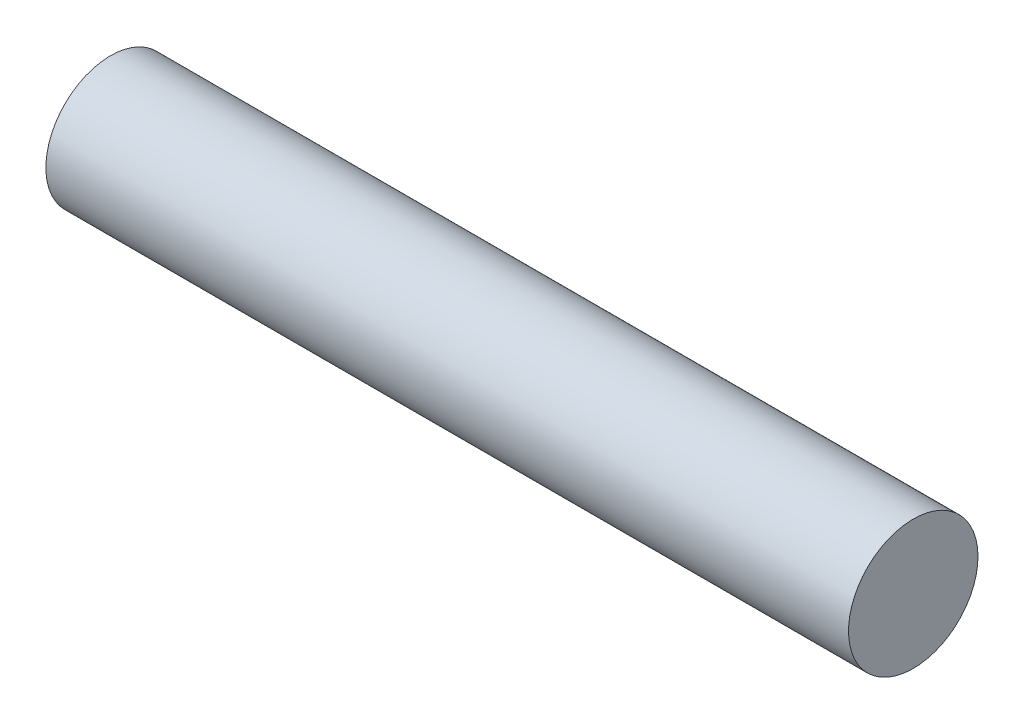
ISO-10303-21;
HEADER;
FILE_DESCRIPTION(('STEP AP214'),'2;1');
FILE_NAME('part.step','',(''),(''),'','','');
FILE_SCHEMA(('AUTOMOTIVE_DESIGN { 1 0 10303 214 1 1 1 1 }'));
ENDSEC;
DATA;
#1=APPLICATION_CONTEXT('core data for automotive mechanical design processes');
#2=APPLICATION_PROTOCOL_DEFINITION('international standard','automotive_design',2000,#1);
#3=PRODUCT_CONTEXT('',#1,'mechanical');
#4=PRODUCT('Part','Part','',(#3));
#5=PRODUCT_RELATED_PRODUCT_CATEGORY('part','',(#4));
#6=PRODUCT_DEFINITION_FORMATION('','',#4);
#7=PRODUCT_DEFINITION_CONTEXT('part definition',#1,'design');
#8=PRODUCT_DEFINITION('design','',#6,#7);
#9=PRODUCT_DEFINITION_SHAPE('','',#8);
#10=(LENGTH_UNIT() NAMED_UNIT(*) SI_UNIT(.MILLI.,.METRE.));
#11=(NAMED_UNIT(*) PLANE_ANGLE_UNIT() SI_UNIT($,.RADIAN.));
#12=(NAMED_UNIT(*) SI_UNIT($,.STERADIAN.) SOLID_ANGLE_UNIT());
#13=UNCERTAINTY_MEASURE_WITH_UNIT(LENGTH_MEASURE(1.E-05),#10,'distance_accuracy_value','');
#14=(GEOMETRIC_REPRESENTATION_CONTEXT(3) GLOBAL_UNCERTAINTY_ASSIGNED_CONTEXT((#13)) GLOBAL_UNIT_ASSIGNED_CONTEXT((#10,
#11,#12)) REPRESENTATION_CONTEXT('',''));
#15=CARTESIAN_POINT('',(0.,0.,0.));
#16=DIRECTION('',(0.,0.,1.));
#17=DIRECTION('',(1.,0.,0.));
#18=AXIS2_PLACEMENT_3D('',#15,#16,#17);
#19=CARTESIAN_POINT('',(5.9055,0.,0.));
#20=DIRECTION('',(-1.,0.,0.));
#21=DIRECTION('',(0.,0.,1.));
#22=AXIS2_PLACEMENT_3D('',#19,#20,#21);
#23=CYLINDRICAL_SURFACE('',#22,0.9525);
#24=CARTESIAN_POINT('',(5.9055,0.,0.));
#25=DIRECTION('',(1.,0.,0.));
#26=DIRECTION('',(0.,0.,-1.));
#27=AXIS2_PLACEMENT_3D('',#24,#25,#26);
#28=CIRCLE('',#27,0.9525);
#29=CARTESIAN_POINT('',(5.9055,0.,-0.9525));
#30=VERTEX_POINT('',#29);
#31=EDGE_CURVE('E12',#30,#30,#28,.T.);
#32=ORIENTED_EDGE('',*,*,#31,.F.);
#33=EDGE_LOOP('',(#32));
#34=FACE_BOUND('',#33,.T.);
#35=CARTESIAN_POINT('',(-5.9055,0.,0.));
#36=DIRECTION('',(1.,0.,0.));
#37=DIRECTION('',(0.,0.,-1.));
#38=AXIS2_PLACEMENT_3D('',#35,#36,#37);
#39=CIRCLE('',#38,0.9525);
#40=CARTESIAN_POINT('',(-5.9055,0.,-0.9525));
#41=VERTEX_POINT('',#40);
#42=EDGE_CURVE('E47',#41,#41,#39,.T.);
#43=ORIENTED_EDGE('',*,*,#42,.T.);
#44=EDGE_LOOP('',(#43));
#45=FACE_BOUND('',#44,.T.);
#46=ADVANCED_FACE('F44',(#34,#45),#23,.T.);
#47=CARTESIAN_POINT('',(5.9055,0.,0.));
#48=DIRECTION('',(1.,0.,0.));
#49=DIRECTION('',(0.,0.,-1.));
#50=AXIS2_PLACEMENT_3D('',#47,#48,#49);
#51=PLANE('',#50);
#52=ORIENTED_EDGE('',*,*,#31,.T.);
#53=EDGE_LOOP('',(#52));
#54=FACE_BOUND('',#53,.T.);
#55=ADVANCED_FACE('F59',(#54),#51,.T.);
#56=CARTESIAN_POINT('',(-5.9055,0.,0.));
#57=DIRECTION('',(1.,0.,0.));
#58=DIRECTION('',(0.,0.,-1.));
#59=AXIS2_PLACEMENT_3D('',#56,#57,#58);
#60=PLANE('',#59);
#61=ORIENTED_EDGE('',*,*,#42,.F.);
#62=EDGE_LOOP('',(#61));
#63=FACE_BOUND('',#62,.T.);
#64=ADVANCED_FACE('F57',(#63),#60,.F.);
#65=CLOSED_SHELL('',(#46,#55,#64));
#66=MANIFOLD_SOLID_BREP('B2',#65);
#67=ADVANCED_BREP_SHAPE_REPRESENTATION('',(#18,#66),#14);
#68=SHAPE_DEFINITION_REPRESENTATION(#9,#67);
ENDSEC;
END-ISO-10303-21;
